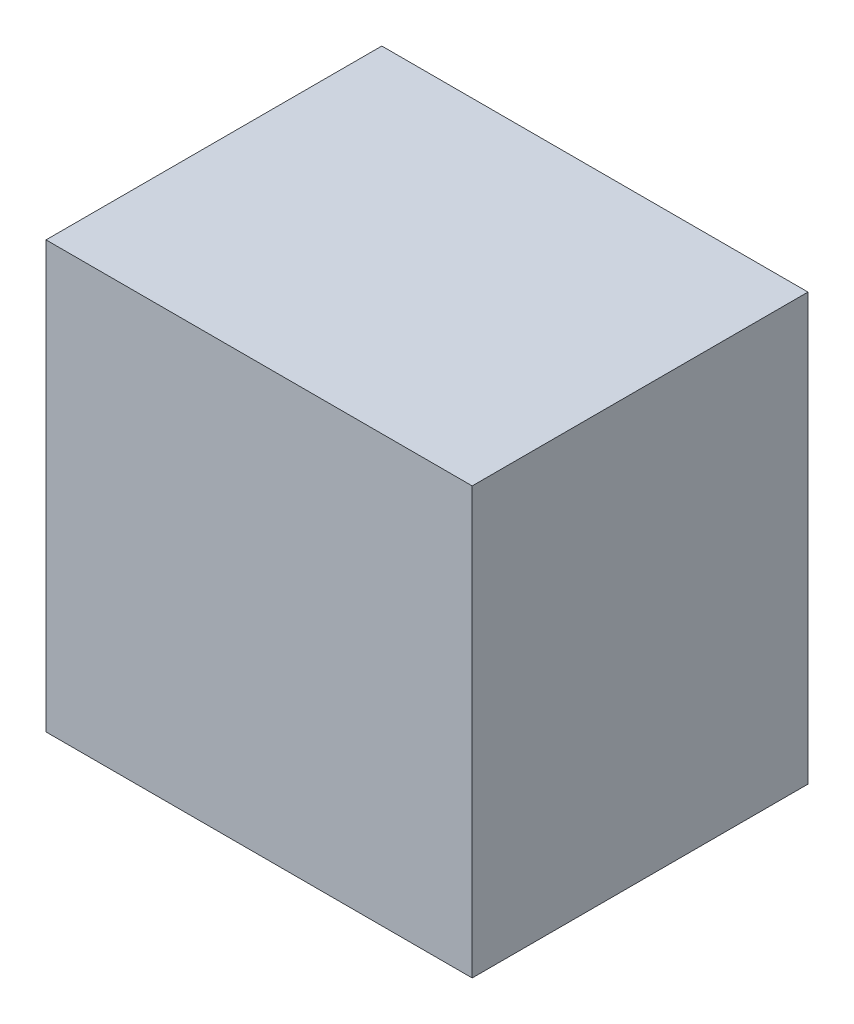
ISO-10303-21;
HEADER;
FILE_DESCRIPTION(('STEP AP214'),'2;1');
FILE_NAME('part.step','',(''),(''),'','','');
FILE_SCHEMA(('AUTOMOTIVE_DESIGN { 1 0 10303 214 1 1 1 1 }'));
ENDSEC;
DATA;
#1=APPLICATION_CONTEXT('core data for automotive mechanical design processes');
#2=APPLICATION_PROTOCOL_DEFINITION('international standard','automotive_design',2000,#1);
#3=PRODUCT_CONTEXT('',#1,'mechanical');
#4=PRODUCT('Part','Part','',(#3));
#5=PRODUCT_RELATED_PRODUCT_CATEGORY('part','',(#4));
#6=PRODUCT_DEFINITION_FORMATION('','',#4);
#7=PRODUCT_DEFINITION_CONTEXT('part definition',#1,'design');
#8=PRODUCT_DEFINITION('design','',#6,#7);
#9=PRODUCT_DEFINITION_SHAPE('','',#8);
#10=(LENGTH_UNIT() NAMED_UNIT(*) SI_UNIT(.MILLI.,.METRE.));
#11=(NAMED_UNIT(*) PLANE_ANGLE_UNIT() SI_UNIT($,.RADIAN.));
#12=(NAMED_UNIT(*) SI_UNIT($,.STERADIAN.) SOLID_ANGLE_UNIT());
#13=UNCERTAINTY_MEASURE_WITH_UNIT(LENGTH_MEASURE(1.E-05),#10,'distance_accuracy_value','');
#14=(GEOMETRIC_REPRESENTATION_CONTEXT(3) GLOBAL_UNCERTAINTY_ASSIGNED_CONTEXT((#13)) GLOBAL_UNIT_ASSIGNED_CONTEXT((#10,
#11,#12)) REPRESENTATION_CONTEXT('',''));
#15=CARTESIAN_POINT('',(0.,0.,0.));
#16=DIRECTION('',(0.,0.,1.));
#17=DIRECTION('',(1.,0.,0.));
#18=AXIS2_PLACEMENT_3D('',#15,#16,#17);
#19=CARTESIAN_POINT('',(0.16500094,-0.1649984,0.));
#20=DIRECTION('',(-1.,0.,0.));
#21=DIRECTION('',(0.,1.,0.));
#22=AXIS2_PLACEMENT_3D('',#19,#20,#21);
#23=PLANE('',#22);
#24=DIRECTION('',(0.,1.,0.));
#25=VECTOR('',#24,1.);
#26=CARTESIAN_POINT('',(0.16500094,-0.1649984,0.));
#27=LINE('',#26,#25);
#28=CARTESIAN_POINT('',(0.16500094,-0.1649984,0.));
#29=VERTEX_POINT('',#28);
#30=CARTESIAN_POINT('',(0.16500094,0.16500094,0.));
#31=VERTEX_POINT('',#30);
#32=EDGE_CURVE('E11',#29,#31,#27,.T.);
#33=ORIENTED_EDGE('',*,*,#32,.T.);
#34=DIRECTION('',(0.,0.,1.));
#35=VECTOR('',#34,1.);
#36=CARTESIAN_POINT('',(0.16500094,0.16500094,0.));
#37=LINE('',#36,#35);
#38=CARTESIAN_POINT('',(0.16500094,0.16500094,0.25999948));
#39=VERTEX_POINT('',#38);
#40=EDGE_CURVE('E24',#31,#39,#37,.T.);
#41=ORIENTED_EDGE('',*,*,#40,.T.);
#42=DIRECTION('',(0.,1.,0.));
#43=VECTOR('',#42,1.);
#44=CARTESIAN_POINT('',(0.16500094,-0.1649984,0.25999948));
#45=LINE('',#44,#43);
#46=CARTESIAN_POINT('',(0.16500094,-0.1649984,0.25999948));
#47=VERTEX_POINT('',#46);
#48=EDGE_CURVE('E87',#47,#39,#45,.T.);
#49=ORIENTED_EDGE('',*,*,#48,.F.);
#50=DIRECTION('',(0.,0.,1.));
#51=VECTOR('',#50,1.);
#52=CARTESIAN_POINT('',(0.16500094,-0.1649984,0.));
#53=LINE('',#52,#51);
#54=EDGE_CURVE('E36',#29,#47,#53,.T.);
#55=ORIENTED_EDGE('',*,*,#54,.F.);
#56=EDGE_LOOP('',(#33,#41,#49,#55));
#57=FACE_BOUND('',#56,.T.);
#58=ADVANCED_FACE('F17',(#57),#23,.F.);
#59=CARTESIAN_POINT('',(0.16500094,0.16500094,0.));
#60=DIRECTION('',(0.,-1.,0.));
#61=DIRECTION('',(-1.,0.,0.));
#62=AXIS2_PLACEMENT_3D('',#59,#60,#61);
#63=PLANE('',#62);
#64=DIRECTION('',(-1.,0.,0.));
#65=VECTOR('',#64,1.);
#66=CARTESIAN_POINT('',(0.16500094,0.16500094,0.));
#67=LINE('',#66,#65);
#68=CARTESIAN_POINT('',(-0.1649984,0.16500094,0.));
#69=VERTEX_POINT('',#68);
#70=EDGE_CURVE('E84',#31,#69,#67,.T.);
#71=ORIENTED_EDGE('',*,*,#70,.T.);
#72=DIRECTION('',(0.,0.,1.));
#73=VECTOR('',#72,1.);
#74=CARTESIAN_POINT('',(-0.1649984,0.16500094,0.));
#75=LINE('',#74,#73);
#76=CARTESIAN_POINT('',(-0.1649984,0.16500094,0.25999948));
#77=VERTEX_POINT('',#76);
#78=EDGE_CURVE('E82',#69,#77,#75,.T.);
#79=ORIENTED_EDGE('',*,*,#78,.T.);
#80=DIRECTION('',(-1.,0.,0.));
#81=VECTOR('',#80,1.);
#82=CARTESIAN_POINT('',(0.16500094,0.16500094,0.25999948));
#83=LINE('',#82,#81);
#84=EDGE_CURVE('E62',#39,#77,#83,.T.);
#85=ORIENTED_EDGE('',*,*,#84,.F.);
#86=ORIENTED_EDGE('',*,*,#40,.F.);
#87=EDGE_LOOP('',(#71,#79,#85,#86));
#88=FACE_BOUND('',#87,.T.);
#89=ADVANCED_FACE('F89',(#88),#63,.F.);
#90=CARTESIAN_POINT('',(-0.1649984,0.16500094,0.));
#91=DIRECTION('',(1.,0.,0.));
#92=DIRECTION('',(0.,-1.,0.));
#93=AXIS2_PLACEMENT_3D('',#90,#91,#92);
#94=PLANE('',#93);
#95=DIRECTION('',(0.,-1.,0.));
#96=VECTOR('',#95,1.);
#97=CARTESIAN_POINT('',(-0.1649984,0.16500094,0.));
#98=LINE('',#97,#96);
#99=CARTESIAN_POINT('',(-0.1649984,-0.1649984,0.));
#100=VERTEX_POINT('',#99);
#101=EDGE_CURVE('E71',#69,#100,#98,.T.);
#102=ORIENTED_EDGE('',*,*,#101,.T.);
#103=DIRECTION('',(0.,0.,1.));
#104=VECTOR('',#103,1.);
#105=CARTESIAN_POINT('',(-0.1649984,-0.1649984,0.));
#106=LINE('',#105,#104);
#107=CARTESIAN_POINT('',(-0.1649984,-0.1649984,0.25999948));
#108=VERTEX_POINT('',#107);
#109=EDGE_CURVE('E65',#100,#108,#106,.T.);
#110=ORIENTED_EDGE('',*,*,#109,.T.);
#111=DIRECTION('',(0.,-1.,0.));
#112=VECTOR('',#111,1.);
#113=CARTESIAN_POINT('',(-0.1649984,0.16500094,0.25999948));
#114=LINE('',#113,#112);
#115=EDGE_CURVE('E57',#77,#108,#114,.T.);
#116=ORIENTED_EDGE('',*,*,#115,.F.);
#117=ORIENTED_EDGE('',*,*,#78,.F.);
#118=EDGE_LOOP('',(#102,#110,#116,#117));
#119=FACE_BOUND('',#118,.T.);
#120=ADVANCED_FACE('F69',(#119),#94,.F.);
#121=CARTESIAN_POINT('',(-0.1649984,-0.1649984,0.));
#122=DIRECTION('',(0.,1.,0.));
#123=DIRECTION('',(1.,0.,0.));
#124=AXIS2_PLACEMENT_3D('',#121,#122,#123);
#125=PLANE('',#124);
#126=DIRECTION('',(1.,0.,0.));
#127=VECTOR('',#126,1.);
#128=CARTESIAN_POINT('',(-0.1649984,-0.1649984,0.));
#129=LINE('',#128,#127);
#130=EDGE_CURVE('E66',#100,#29,#129,.T.);
#131=ORIENTED_EDGE('',*,*,#130,.T.);
#132=ORIENTED_EDGE('',*,*,#54,.T.);
#133=DIRECTION('',(1.,0.,0.));
#134=VECTOR('',#133,1.);
#135=CARTESIAN_POINT('',(-0.1649984,-0.1649984,0.25999948));
#136=LINE('',#135,#134);
#137=EDGE_CURVE('E61',#108,#47,#136,.T.);
#138=ORIENTED_EDGE('',*,*,#137,.F.);
#139=ORIENTED_EDGE('',*,*,#109,.F.);
#140=EDGE_LOOP('',(#131,#132,#138,#139));
#141=FACE_BOUND('',#140,.T.);
#142=ADVANCED_FACE('F76',(#141),#125,.F.);
#143=CARTESIAN_POINT('',(1.269999998502E-06,1.270000002056E-06,0.));
#144=DIRECTION('',(0.,0.,1.));
#145=DIRECTION('',(1.,0.,0.));
#146=AXIS2_PLACEMENT_3D('',#143,#144,#145);
#147=PLANE('',#146);
#148=ORIENTED_EDGE('',*,*,#130,.F.);
#149=ORIENTED_EDGE('',*,*,#101,.F.);
#150=ORIENTED_EDGE('',*,*,#70,.F.);
#151=ORIENTED_EDGE('',*,*,#32,.F.);
#152=EDGE_LOOP('',(#148,#149,#150,#151));
#153=FACE_BOUND('',#152,.T.);
#154=ADVANCED_FACE('F91',(#153),#147,.F.);
#155=CARTESIAN_POINT('',(1.269999998502E-06,1.270000002056E-06,0.25999948));
#156=DIRECTION('',(0.,0.,1.));
#157=DIRECTION('',(1.,0.,0.));
#158=AXIS2_PLACEMENT_3D('',#155,#156,#157);
#159=PLANE('',#158);
#160=ORIENTED_EDGE('',*,*,#48,.T.);
#161=ORIENTED_EDGE('',*,*,#84,.T.);
#162=ORIENTED_EDGE('',*,*,#115,.T.);
#163=ORIENTED_EDGE('',*,*,#137,.T.);
#164=EDGE_LOOP('',(#160,#161,#162,#163));
#165=FACE_BOUND('',#164,.T.);
#166=ADVANCED_FACE('F59',(#165),#159,.T.);
#167=CLOSED_SHELL('',(#58,#89,#120,#142,#154,#166));
#168=MANIFOLD_SOLID_BREP('B1',#167);
#169=ADVANCED_BREP_SHAPE_REPRESENTATION('',(#18,#168),#14);
#170=SHAPE_DEFINITION_REPRESENTATION(#9,#169);
ENDSEC;
END-ISO-10303-21;
